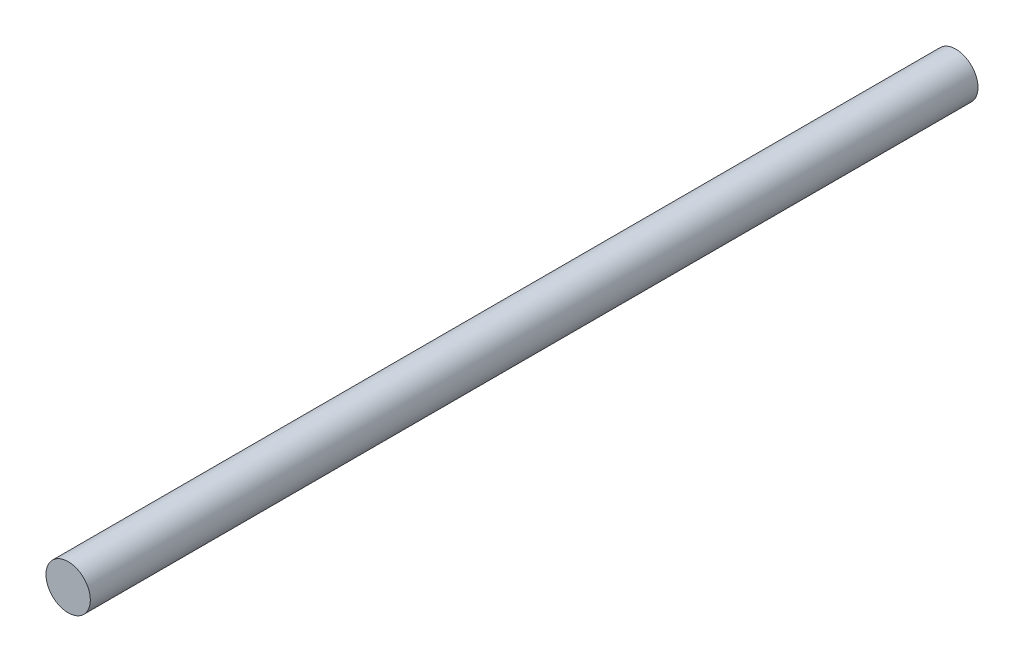
ISO-10303-21;
HEADER;
FILE_DESCRIPTION(('STEP AP214'),'2;1');
FILE_NAME('part.step','',(''),(''),'','','');
FILE_SCHEMA(('AUTOMOTIVE_DESIGN { 1 0 10303 214 1 1 1 1 }'));
ENDSEC;
DATA;
#1=APPLICATION_CONTEXT('core data for automotive mechanical design processes');
#2=APPLICATION_PROTOCOL_DEFINITION('international standard','automotive_design',2000,#1);
#3=PRODUCT_CONTEXT('',#1,'mechanical');
#4=PRODUCT('Part','Part','',(#3));
#5=PRODUCT_RELATED_PRODUCT_CATEGORY('part','',(#4));
#6=PRODUCT_DEFINITION_FORMATION('','',#4);
#7=PRODUCT_DEFINITION_CONTEXT('part definition',#1,'design');
#8=PRODUCT_DEFINITION('design','',#6,#7);
#9=PRODUCT_DEFINITION_SHAPE('','',#8);
#10=(LENGTH_UNIT() NAMED_UNIT(*) SI_UNIT(.MILLI.,.METRE.));
#11=(NAMED_UNIT(*) PLANE_ANGLE_UNIT() SI_UNIT($,.RADIAN.));
#12=(NAMED_UNIT(*) SI_UNIT($,.STERADIAN.) SOLID_ANGLE_UNIT());
#13=UNCERTAINTY_MEASURE_WITH_UNIT(LENGTH_MEASURE(1.E-05),#10,'distance_accuracy_value','');
#14=(GEOMETRIC_REPRESENTATION_CONTEXT(3) GLOBAL_UNCERTAINTY_ASSIGNED_CONTEXT((#13)) GLOBAL_UNIT_ASSIGNED_CONTEXT((#10,
#11,#12)) REPRESENTATION_CONTEXT('',''));
#15=CARTESIAN_POINT('',(0.,0.,0.));
#16=DIRECTION('',(0.,0.,1.));
#17=DIRECTION('',(1.,0.,0.));
#18=AXIS2_PLACEMENT_3D('',#15,#16,#17);
#19=CARTESIAN_POINT('',(0.,0.,200.));
#20=DIRECTION('',(0.,0.,-1.));
#21=DIRECTION('',(-1.,0.,0.));
#22=AXIS2_PLACEMENT_3D('',#19,#20,#21);
#23=CYLINDRICAL_SURFACE('',#22,10.);
#24=CARTESIAN_POINT('',(0.,0.,200.));
#25=DIRECTION('',(0.,0.,1.));
#26=DIRECTION('',(1.,0.,0.));
#27=AXIS2_PLACEMENT_3D('',#24,#25,#26);
#28=CIRCLE('',#27,10.);
#29=CARTESIAN_POINT('',(10.,0.,200.));
#30=VERTEX_POINT('',#29);
#31=EDGE_CURVE('E10',#30,#30,#28,.T.);
#32=ORIENTED_EDGE('',*,*,#31,.F.);
#33=EDGE_LOOP('',(#32));
#34=FACE_BOUND('',#33,.T.);
#35=CARTESIAN_POINT('',(0.,0.,-200.));
#36=DIRECTION('',(0.,0.,1.));
#37=DIRECTION('',(1.,0.,0.));
#38=AXIS2_PLACEMENT_3D('',#35,#36,#37);
#39=CIRCLE('',#38,10.);
#40=CARTESIAN_POINT('',(10.,0.,-200.));
#41=VERTEX_POINT('',#40);
#42=EDGE_CURVE('E33',#41,#41,#39,.T.);
#43=ORIENTED_EDGE('',*,*,#42,.T.);
#44=EDGE_LOOP('',(#43));
#45=FACE_BOUND('',#44,.T.);
#46=ADVANCED_FACE('F30',(#34,#45),#23,.T.);
#47=CARTESIAN_POINT('',(0.,0.,200.));
#48=DIRECTION('',(0.,0.,1.));
#49=DIRECTION('',(1.,0.,0.));
#50=AXIS2_PLACEMENT_3D('',#47,#48,#49);
#51=PLANE('',#50);
#52=ORIENTED_EDGE('',*,*,#31,.T.);
#53=EDGE_LOOP('',(#52));
#54=FACE_BOUND('',#53,.T.);
#55=ADVANCED_FACE('F45',(#54),#51,.T.);
#56=CARTESIAN_POINT('',(0.,0.,-200.));
#57=DIRECTION('',(0.,0.,1.));
#58=DIRECTION('',(1.,0.,0.));
#59=AXIS2_PLACEMENT_3D('',#56,#57,#58);
#60=PLANE('',#59);
#61=ORIENTED_EDGE('',*,*,#42,.F.);
#62=EDGE_LOOP('',(#61));
#63=FACE_BOUND('',#62,.T.);
#64=ADVANCED_FACE('F43',(#63),#60,.F.);
#65=CLOSED_SHELL('',(#46,#55,#64));
#66=MANIFOLD_SOLID_BREP('B2',#65);
#67=ADVANCED_BREP_SHAPE_REPRESENTATION('',(#18,#66),#14);
#68=SHAPE_DEFINITION_REPRESENTATION(#9,#67);
ENDSEC;
END-ISO-10303-21;
